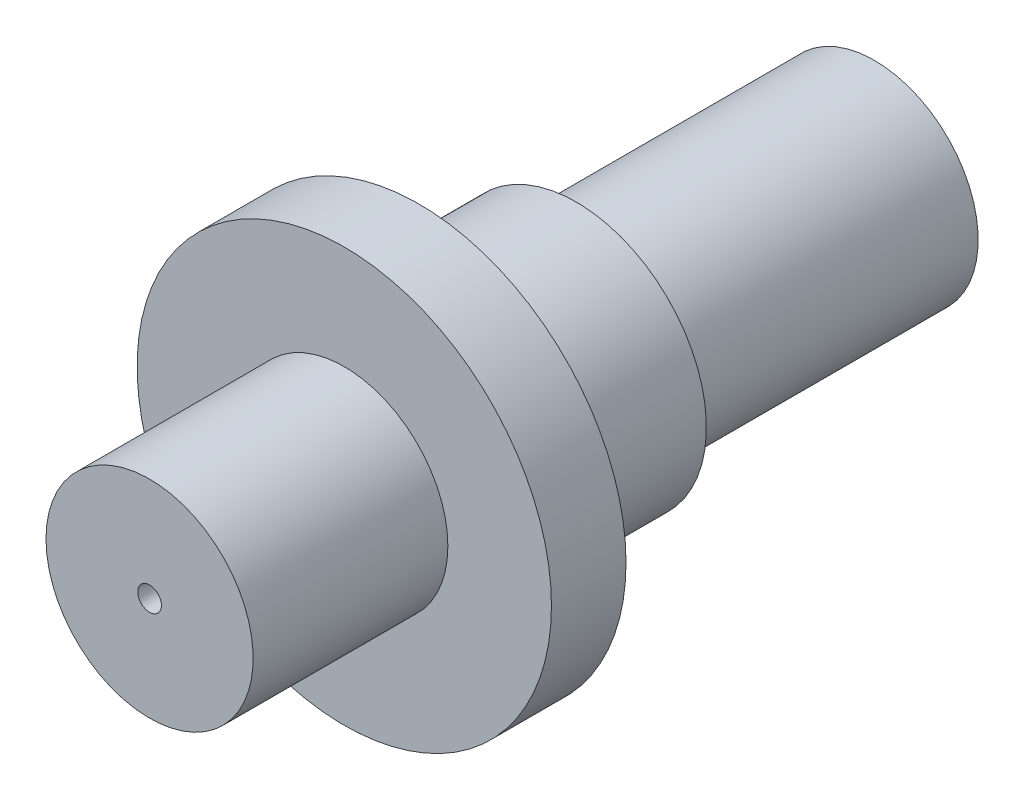
ISO-10303-21;
HEADER;
FILE_DESCRIPTION(('STEP AP214'),'2;1');
FILE_NAME('part.step','',(''),(''),'','','');
FILE_SCHEMA(('AUTOMOTIVE_DESIGN { 1 0 10303 214 1 1 1 1 }'));
ENDSEC;
DATA;
#1=APPLICATION_CONTEXT('core data for automotive mechanical design processes');
#2=APPLICATION_PROTOCOL_DEFINITION('international standard','automotive_design',2000,#1);
#3=PRODUCT_CONTEXT('',#1,'mechanical');
#4=PRODUCT('Part','Part','',(#3));
#5=PRODUCT_RELATED_PRODUCT_CATEGORY('part','',(#4));
#6=PRODUCT_DEFINITION_FORMATION('','',#4);
#7=PRODUCT_DEFINITION_CONTEXT('part definition',#1,'design');
#8=PRODUCT_DEFINITION('design','',#6,#7);
#9=PRODUCT_DEFINITION_SHAPE('','',#8);
#10=(LENGTH_UNIT() NAMED_UNIT(*) SI_UNIT(.MILLI.,.METRE.));
#11=(NAMED_UNIT(*) PLANE_ANGLE_UNIT() SI_UNIT($,.RADIAN.));
#12=(NAMED_UNIT(*) SI_UNIT($,.STERADIAN.) SOLID_ANGLE_UNIT());
#13=UNCERTAINTY_MEASURE_WITH_UNIT(LENGTH_MEASURE(1.E-05),#10,'distance_accuracy_value','');
#14=(GEOMETRIC_REPRESENTATION_CONTEXT(3) GLOBAL_UNCERTAINTY_ASSIGNED_CONTEXT((#13)) GLOBAL_UNIT_ASSIGNED_CONTEXT((#10,
#11,#12)) REPRESENTATION_CONTEXT('',''));
#15=CARTESIAN_POINT('',(0.,0.,0.));
#16=DIRECTION('',(0.,0.,1.));
#17=DIRECTION('',(1.,0.,0.));
#18=AXIS2_PLACEMENT_3D('',#15,#16,#17);
#19=CARTESIAN_POINT('',(0.,0.,2.286));
#20=DIRECTION('',(0.,0.,-1.));
#21=DIRECTION('',(-1.,0.,0.));
#22=AXIS2_PLACEMENT_3D('',#19,#20,#21);
#23=CYLINDRICAL_SURFACE('',#22,6.35);
#24=CARTESIAN_POINT('',(0.,0.,2.286));
#25=DIRECTION('',(0.,0.,1.));
#26=DIRECTION('',(1.,0.,0.));
#27=AXIS2_PLACEMENT_3D('',#24,#25,#26);
#28=CIRCLE('',#27,6.35);
#29=CARTESIAN_POINT('',(6.35,0.,2.286));
#30=VERTEX_POINT('',#29);
#31=EDGE_CURVE('E74',#30,#30,#28,.T.);
#32=ORIENTED_EDGE('',*,*,#31,.F.);
#33=EDGE_LOOP('',(#32));
#34=FACE_BOUND('',#33,.T.);
#35=CARTESIAN_POINT('',(0.,0.,0.));
#36=DIRECTION('',(0.,0.,1.));
#37=DIRECTION('',(1.,0.,0.));
#38=AXIS2_PLACEMENT_3D('',#35,#36,#37);
#39=CIRCLE('',#38,6.35);
#40=CARTESIAN_POINT('',(6.35,0.,0.));
#41=VERTEX_POINT('',#40);
#42=EDGE_CURVE('E42',#41,#41,#39,.T.);
#43=ORIENTED_EDGE('',*,*,#42,.T.);
#44=EDGE_LOOP('',(#43));
#45=FACE_BOUND('',#44,.T.);
#46=ADVANCED_FACE('F39',(#34,#45),#23,.T.);
#47=CARTESIAN_POINT('',(0.,0.,2.286));
#48=DIRECTION('',(0.,0.,1.));
#49=DIRECTION('',(1.,0.,0.));
#50=AXIS2_PLACEMENT_3D('',#47,#48,#49);
#51=PLANE('',#50);
#52=CARTESIAN_POINT('',(0.,0.,2.286));
#53=DIRECTION('',(0.,0.,1.));
#54=DIRECTION('',(1.,0.,0.));
#55=AXIS2_PLACEMENT_3D('',#52,#53,#54);
#56=CIRCLE('',#55,3.175);
#57=CARTESIAN_POINT('',(3.175,0.,2.286));
#58=VERTEX_POINT('',#57);
#59=EDGE_CURVE('E53',#58,#58,#56,.T.);
#60=ORIENTED_EDGE('',*,*,#59,.F.);
#61=EDGE_LOOP('',(#60));
#62=FACE_BOUND('',#61,.T.);
#63=ORIENTED_EDGE('',*,*,#31,.T.);
#64=EDGE_LOOP('',(#63));
#65=FACE_BOUND('',#64,.T.);
#66=ADVANCED_FACE('F87',(#62,#65),#51,.T.);
#67=CARTESIAN_POINT('',(0.,0.,0.));
#68=DIRECTION('',(0.,0.,1.));
#69=DIRECTION('',(1.,0.,0.));
#70=AXIS2_PLACEMENT_3D('',#67,#68,#69);
#71=PLANE('',#70);
#72=CARTESIAN_POINT('',(0.,0.,0.));
#73=DIRECTION('',(0.,0.,-1.));
#74=DIRECTION('',(-1.,0.,0.));
#75=AXIS2_PLACEMENT_3D('',#72,#73,#74);
#76=CIRCLE('',#75,3.9878);
#77=CARTESIAN_POINT('',(-3.9878,0.,0.));
#78=VERTEX_POINT('',#77);
#79=EDGE_CURVE('E47',#78,#78,#76,.T.);
#80=ORIENTED_EDGE('',*,*,#79,.F.);
#81=EDGE_LOOP('',(#80));
#82=FACE_BOUND('',#81,.T.);
#83=ORIENTED_EDGE('',*,*,#42,.F.);
#84=EDGE_LOOP('',(#83));
#85=FACE_BOUND('',#84,.T.);
#86=ADVANCED_FACE('F84',(#82,#85),#71,.F.);
#87=CARTESIAN_POINT('',(0.,0.,8.255));
#88=DIRECTION('',(0.,0.,-1.));
#89=DIRECTION('',(-1.,0.,0.));
#90=AXIS2_PLACEMENT_3D('',#87,#88,#89);
#91=CYLINDRICAL_SURFACE('',#90,3.175);
#92=ORIENTED_EDGE('',*,*,#59,.T.);
#93=EDGE_LOOP('',(#92));
#94=FACE_BOUND('',#93,.T.);
#95=CARTESIAN_POINT('',(0.,0.,8.255));
#96=DIRECTION('',(0.,0.,-1.));
#97=DIRECTION('',(-1.,0.,0.));
#98=AXIS2_PLACEMENT_3D('',#95,#96,#97);
#99=CIRCLE('',#98,3.175);
#100=CARTESIAN_POINT('',(-3.175,0.,8.255));
#101=VERTEX_POINT('',#100);
#102=EDGE_CURVE('E67',#101,#101,#99,.T.);
#103=ORIENTED_EDGE('',*,*,#102,.T.);
#104=EDGE_LOOP('',(#103));
#105=FACE_BOUND('',#104,.T.);
#106=ADVANCED_FACE('F86',(#94,#105),#91,.T.);
#107=CARTESIAN_POINT('',(0.,0.,8.255));
#108=DIRECTION('',(0.,0.,-1.));
#109=DIRECTION('',(-1.,0.,0.));
#110=AXIS2_PLACEMENT_3D('',#107,#108,#109);
#111=PLANE('',#110);
#112=CARTESIAN_POINT('',(0.,0.,8.255));
#113=DIRECTION('',(0.,0.,1.));
#114=DIRECTION('',(1.,0.,0.));
#115=AXIS2_PLACEMENT_3D('',#112,#113,#114);
#116=CIRCLE('',#115,0.362927276941078);
#117=CARTESIAN_POINT('',(0.362927276941078,0.,8.255));
#118=VERTEX_POINT('',#117);
#119=EDGE_CURVE('E57',#118,#118,#116,.T.);
#120=ORIENTED_EDGE('',*,*,#119,.F.);
#121=EDGE_LOOP('',(#120));
#122=FACE_BOUND('',#121,.T.);
#123=ORIENTED_EDGE('',*,*,#102,.F.);
#124=EDGE_LOOP('',(#123));
#125=FACE_BOUND('',#124,.T.);
#126=ADVANCED_FACE('F93',(#122,#125),#111,.F.);
#127=CARTESIAN_POINT('',(0.,0.,-4.826));
#128=DIRECTION('',(0.,0.,1.));
#129=DIRECTION('',(1.,0.,0.));
#130=AXIS2_PLACEMENT_3D('',#127,#128,#129);
#131=CYLINDRICAL_SURFACE('',#130,3.9878);
#132=CARTESIAN_POINT('',(0.,0.,-4.826));
#133=DIRECTION('',(0.,0.,-1.));
#134=DIRECTION('',(-1.,0.,0.));
#135=AXIS2_PLACEMENT_3D('',#132,#133,#134);
#136=CIRCLE('',#135,3.9878);
#137=CARTESIAN_POINT('',(-3.9878,0.,-4.826));
#138=VERTEX_POINT('',#137);
#139=EDGE_CURVE('E63',#138,#138,#136,.T.);
#140=ORIENTED_EDGE('',*,*,#139,.F.);
#141=EDGE_LOOP('',(#140));
#142=FACE_BOUND('',#141,.T.);
#143=ORIENTED_EDGE('',*,*,#79,.T.);
#144=EDGE_LOOP('',(#143));
#145=FACE_BOUND('',#144,.T.);
#146=ADVANCED_FACE('F124',(#142,#145),#131,.T.);
#147=CARTESIAN_POINT('',(0.,0.,-4.826));
#148=DIRECTION('',(0.,0.,-1.));
#149=DIRECTION('',(-1.,0.,0.));
#150=AXIS2_PLACEMENT_3D('',#147,#148,#149);
#151=PLANE('',#150);
#152=CARTESIAN_POINT('',(0.,0.,-4.826));
#153=DIRECTION('',(0.,0.,-1.));
#154=DIRECTION('',(-1.,0.,0.));
#155=AXIS2_PLACEMENT_3D('',#152,#153,#154);
#156=CIRCLE('',#155,3.175);
#157=CARTESIAN_POINT('',(-3.175,0.,-4.826));
#158=VERTEX_POINT('',#157);
#159=EDGE_CURVE('E11',#158,#158,#156,.T.);
#160=ORIENTED_EDGE('',*,*,#159,.F.);
#161=EDGE_LOOP('',(#160));
#162=FACE_BOUND('',#161,.T.);
#163=ORIENTED_EDGE('',*,*,#139,.T.);
#164=EDGE_LOOP('',(#163));
#165=FACE_BOUND('',#164,.T.);
#166=ADVANCED_FACE('F129',(#162,#165),#151,.T.);
#167=CARTESIAN_POINT('',(0.,0.,-45.1752561210692));
#168=DIRECTION('',(0.,0.,1.));
#169=DIRECTION('',(1.,0.,0.));
#170=AXIS2_PLACEMENT_3D('',#167,#168,#169);
#171=CYLINDRICAL_SURFACE('',#170,3.175);
#172=ORIENTED_EDGE('',*,*,#159,.T.);
#173=EDGE_LOOP('',(#172));
#174=FACE_BOUND('',#173,.T.);
#175=CARTESIAN_POINT('',(0.,0.,-13.97));
#176=DIRECTION('',(0.,0.,-1.));
#177=DIRECTION('',(-1.,0.,0.));
#178=AXIS2_PLACEMENT_3D('',#175,#176,#177);
#179=CIRCLE('',#178,3.175);
#180=CARTESIAN_POINT('',(-3.175,0.,-13.97));
#181=VERTEX_POINT('',#180);
#182=EDGE_CURVE('E59',#181,#181,#179,.T.);
#183=ORIENTED_EDGE('',*,*,#182,.F.);
#184=EDGE_LOOP('',(#183));
#185=FACE_BOUND('',#184,.T.);
#186=ADVANCED_FACE('F139',(#174,#185),#171,.T.);
#187=CARTESIAN_POINT('',(0.,0.,-13.97));
#188=DIRECTION('',(0.,0.,-1.));
#189=DIRECTION('',(-1.,0.,0.));
#190=AXIS2_PLACEMENT_3D('',#187,#188,#189);
#191=PLANE('',#190);
#192=CARTESIAN_POINT('',(0.,0.,-13.97));
#193=DIRECTION('',(0.,0.,1.));
#194=DIRECTION('',(1.,0.,0.));
#195=AXIS2_PLACEMENT_3D('',#192,#193,#194);
#196=CIRCLE('',#195,0.362927276941078);
#197=CARTESIAN_POINT('',(0.362927276941078,0.,-13.97));
#198=VERTEX_POINT('',#197);
#199=EDGE_CURVE('E64',#198,#198,#196,.T.);
#200=ORIENTED_EDGE('',*,*,#199,.T.);
#201=EDGE_LOOP('',(#200));
#202=FACE_BOUND('',#201,.T.);
#203=ORIENTED_EDGE('',*,*,#182,.T.);
#204=EDGE_LOOP('',(#203));
#205=FACE_BOUND('',#204,.T.);
#206=ADVANCED_FACE('F149',(#202,#205),#191,.T.);
#207=CARTESIAN_POINT('',(0.,0.,-13.97));
#208=DIRECTION('',(0.,0.,1.));
#209=DIRECTION('',(1.,0.,0.));
#210=AXIS2_PLACEMENT_3D('',#207,#208,#209);
#211=CYLINDRICAL_SURFACE('',#210,0.362927276941078);
#212=ORIENTED_EDGE('',*,*,#199,.F.);
#213=EDGE_LOOP('',(#212));
#214=FACE_BOUND('',#213,.T.);
#215=ORIENTED_EDGE('',*,*,#119,.T.);
#216=EDGE_LOOP('',(#215));
#217=FACE_BOUND('',#216,.T.);
#218=ADVANCED_FACE('F165',(#214,#217),#211,.F.);
#219=CLOSED_SHELL('',(#46,#66,#86,#106,#126,#146,#166,#186,#206,#218));
#220=MANIFOLD_SOLID_BREP('B2',#219);
#221=ADVANCED_BREP_SHAPE_REPRESENTATION('',(#18,#220),#14);
#222=SHAPE_DEFINITION_REPRESENTATION(#9,#221);
ENDSEC;
END-ISO-10303-21;
